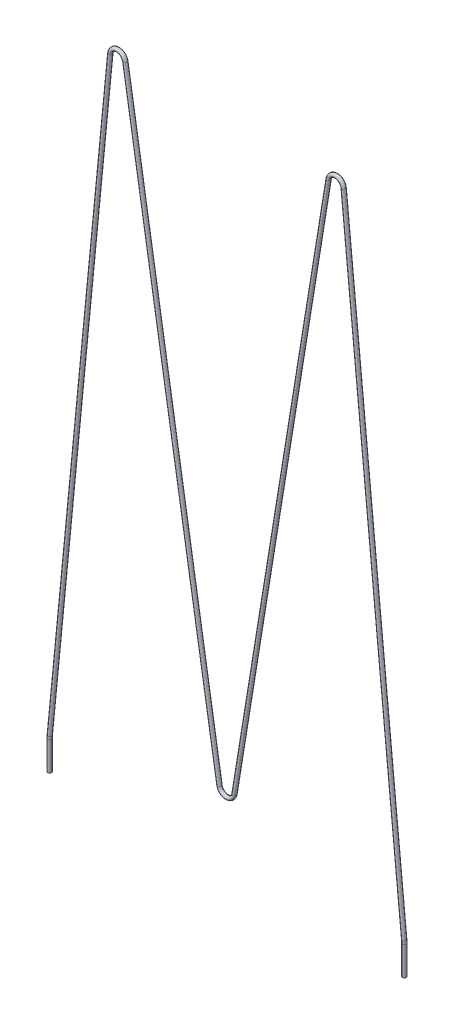
ISO-10303-21;
HEADER;
FILE_DESCRIPTION(('STEP AP214'),'2;1');
FILE_NAME('part.step','',(''),(''),'','','');
FILE_SCHEMA(('AUTOMOTIVE_DESIGN { 1 0 10303 214 1 1 1 1 }'));
ENDSEC;
DATA;
#1=APPLICATION_CONTEXT('core data for automotive mechanical design processes');
#2=APPLICATION_PROTOCOL_DEFINITION('international standard','automotive_design',2000,#1);
#3=PRODUCT_CONTEXT('',#1,'mechanical');
#4=PRODUCT('Part','Part','',(#3));
#5=PRODUCT_RELATED_PRODUCT_CATEGORY('part','',(#4));
#6=PRODUCT_DEFINITION_FORMATION('','',#4);
#7=PRODUCT_DEFINITION_CONTEXT('part definition',#1,'design');
#8=PRODUCT_DEFINITION('design','',#6,#7);
#9=PRODUCT_DEFINITION_SHAPE('','',#8);
#10=(LENGTH_UNIT() NAMED_UNIT(*) SI_UNIT(.MILLI.,.METRE.));
#11=(NAMED_UNIT(*) PLANE_ANGLE_UNIT() SI_UNIT($,.RADIAN.));
#12=(NAMED_UNIT(*) SI_UNIT($,.STERADIAN.) SOLID_ANGLE_UNIT());
#13=UNCERTAINTY_MEASURE_WITH_UNIT(LENGTH_MEASURE(1.E-05),#10,'distance_accuracy_value','');
#14=(GEOMETRIC_REPRESENTATION_CONTEXT(3) GLOBAL_UNCERTAINTY_ASSIGNED_CONTEXT((#13)) GLOBAL_UNIT_ASSIGNED_CONTEXT((#10,
#11,#12)) REPRESENTATION_CONTEXT('',''));
#15=CARTESIAN_POINT('',(0.,0.,0.));
#16=DIRECTION('',(0.,0.,1.));
#17=DIRECTION('',(1.,0.,0.));
#18=AXIS2_PLACEMENT_3D('',#15,#16,#17);
#19=CARTESIAN_POINT('',(11.7,13.902727498159,0.));
#20=DIRECTION('',(0.,-1.,0.));
#21=DIRECTION('',(1.,0.,0.));
#22=AXIS2_PLACEMENT_3D('',#19,#20,#21);
#23=CYLINDRICAL_SURFACE('',#22,0.125);
#24=CARTESIAN_POINT('',(11.7,13.902727498159,0.));
#25=DIRECTION('',(0.,-1.,0.));
#26=DIRECTION('',(0.,0.,1.));
#27=AXIS2_PLACEMENT_3D('',#24,#25,#26);
#28=CIRCLE('',#27,0.125);
#29=CARTESIAN_POINT('',(11.825,13.902727498159,0.));
#30=VERTEX_POINT('',#29);
#31=EDGE_CURVE('E36',#30,#30,#28,.T.);
#32=ORIENTED_EDGE('',*,*,#31,.T.);
#33=EDGE_LOOP('',(#32));
#34=FACE_BOUND('',#33,.T.);
#35=CARTESIAN_POINT('',(11.7,12.,0.));
#36=DIRECTION('',(0.,-1.,0.));
#37=DIRECTION('',(0.,0.,1.));
#38=AXIS2_PLACEMENT_3D('',#35,#36,#37);
#39=CIRCLE('',#38,0.125);
#40=CARTESIAN_POINT('',(11.7,12.,0.125));
#41=VERTEX_POINT('',#40);
#42=EDGE_CURVE('E10',#41,#41,#39,.T.);
#43=ORIENTED_EDGE('',*,*,#42,.F.);
#44=EDGE_LOOP('',(#43));
#45=FACE_BOUND('',#44,.T.);
#46=ADVANCED_FACE('F30',(#34,#45),#23,.T.);
#47=CARTESIAN_POINT('',(9.7,13.902727498159,0.));
#48=DIRECTION('',(0.,0.,-1.));
#49=DIRECTION('',(-1.,0.,0.));
#50=AXIS2_PLACEMENT_3D('',#47,#48,#49);
#51=TOROIDAL_SURFACE('',#50,2.00000000000001,0.125);
#52=CARTESIAN_POINT('',(11.6905603896414,14.096813394583,0.));
#53=DIRECTION('',(0.0970429482120156,-0.995280194820695,0.));
#54=DIRECTION('',(0.,0.,1.));
#55=AXIS2_PLACEMENT_3D('',#52,#53,#54);
#56=CIRCLE('',#55,0.125);
#57=CARTESIAN_POINT('',(11.814970413994,14.1089437631095,0.));
#58=VERTEX_POINT('',#57);
#59=EDGE_CURVE('E40',#58,#58,#56,.T.);
#60=CARTESIAN_POINT('',(9.7,13.902727498159,0.));
#61=DIRECTION('',(0.,0.,-1.));
#62=DIRECTION('',(-1.,0.,0.));
#63=AXIS2_PLACEMENT_3D('',#60,#61,#62);
#64=CIRCLE('',#63,2.12500000000001);
#65=EDGE_CURVE('',#58,#30,#64,.T.);
#66=ORIENTED_EDGE('',*,*,#59,.T.);
#67=ORIENTED_EDGE('',*,*,#31,.F.);
#68=ORIENTED_EDGE('',*,*,#65,.T.);
#69=ORIENTED_EDGE('',*,*,#65,.F.);
#70=EDGE_LOOP('',(#66,#68,#67,#69));
#71=FACE_BOUND('',#70,.T.);
#72=ADVANCED_FACE('F92',(#71),#51,.T.);
#73=CARTESIAN_POINT('',(7.69764009741035,55.048521474106,0.));
#74=DIRECTION('',(0.0970429482120274,-0.995280194820694,0.));
#75=DIRECTION('',(0.995280194820694,0.0970429482120274,0.));
#76=AXIS2_PLACEMENT_3D('',#73,#74,#75);
#77=CYLINDRICAL_SURFACE('',#76,0.125);
#78=CARTESIAN_POINT('',(7.69764009741035,55.048521474106,0.));
#79=DIRECTION('',(0.0970429482120156,-0.995280194820695,0.));
#80=DIRECTION('',(0.,0.,1.));
#81=AXIS2_PLACEMENT_3D('',#78,#79,#80);
#82=CIRCLE('',#81,0.125);
#83=CARTESIAN_POINT('',(7.82205012176294,55.0606518426325,0.));
#84=VERTEX_POINT('',#83);
#85=EDGE_CURVE('E44',#84,#84,#82,.T.);
#86=ORIENTED_EDGE('',*,*,#85,.T.);
#87=EDGE_LOOP('',(#86));
#88=FACE_BOUND('',#87,.T.);
#89=ORIENTED_EDGE('',*,*,#59,.F.);
#90=EDGE_LOOP('',(#89));
#91=FACE_BOUND('',#90,.T.);
#92=ADVANCED_FACE('F96',(#88,#91),#77,.T.);
#93=CARTESIAN_POINT('',(7.2,55.,0.));
#94=DIRECTION('',(0.,0.,-1.));
#95=DIRECTION('',(-1.,0.,0.));
#96=AXIS2_PLACEMENT_3D('',#93,#94,#95);
#97=TOROIDAL_SURFACE('',#96,0.500000000000007,0.125);
#98=CARTESIAN_POINT('',(6.70646471715028,55.0801431505648,0.));
#99=DIRECTION('',(0.16028630112956,0.987070565699436,0.));
#100=DIRECTION('',(0.,0.,1.));
#101=AXIS2_PLACEMENT_3D('',#98,#99,#100);
#102=CIRCLE('',#101,0.125);
#103=CARTESIAN_POINT('',(6.58308089643785,55.100178938206,0.));
#104=VERTEX_POINT('',#103);
#105=EDGE_CURVE('E49',#104,#104,#102,.T.);
#106=CARTESIAN_POINT('',(7.2,55.,0.));
#107=DIRECTION('',(0.,0.,-1.));
#108=DIRECTION('',(-1.,0.,0.));
#109=AXIS2_PLACEMENT_3D('',#106,#107,#108);
#110=CIRCLE('',#109,0.625000000000007);
#111=EDGE_CURVE('',#104,#84,#110,.T.);
#112=ORIENTED_EDGE('',*,*,#105,.T.);
#113=ORIENTED_EDGE('',*,*,#85,.F.);
#114=ORIENTED_EDGE('',*,*,#111,.T.);
#115=ORIENTED_EDGE('',*,*,#111,.F.);
#116=EDGE_LOOP('',(#112,#114,#113,#115));
#117=FACE_BOUND('',#116,.T.);
#118=ADVANCED_FACE('F102',(#117),#97,.T.);
#119=CARTESIAN_POINT('',(0.493535282849715,16.8198568494352,0.));
#120=DIRECTION('',(0.160286301129552,0.987070565699437,0.));
#121=DIRECTION('',(-0.987070565699437,0.160286301129552,0.));
#122=AXIS2_PLACEMENT_3D('',#119,#120,#121);
#123=CYLINDRICAL_SURFACE('',#122,0.125);
#124=CARTESIAN_POINT('',(0.493535282849715,16.8198568494352,0.));
#125=DIRECTION('',(0.16028630112956,0.987070565699436,0.));
#126=DIRECTION('',(0.,0.,1.));
#127=AXIS2_PLACEMENT_3D('',#124,#125,#126);
#128=CIRCLE('',#127,0.125);
#129=CARTESIAN_POINT('',(0.616919103562146,16.799821061794,0.));
#130=VERTEX_POINT('',#129);
#131=EDGE_CURVE('E52',#130,#130,#128,.T.);
#132=ORIENTED_EDGE('',*,*,#131,.T.);
#133=EDGE_LOOP('',(#132));
#134=FACE_BOUND('',#133,.T.);
#135=ORIENTED_EDGE('',*,*,#105,.F.);
#136=EDGE_LOOP('',(#135));
#137=FACE_BOUND('',#136,.T.);
#138=ADVANCED_FACE('F109',(#134,#137),#123,.T.);
#139=CARTESIAN_POINT('',(0.,16.9,0.));
#140=DIRECTION('',(0.,0.,1.));
#141=DIRECTION('',(1.,0.,0.));
#142=AXIS2_PLACEMENT_3D('',#139,#140,#141);
#143=TOROIDAL_SURFACE('',#142,0.499999999999996,0.125);
#144=CARTESIAN_POINT('',(-0.493535282849713,16.8198568494352,0.));
#145=DIRECTION('',(0.160286301129549,-0.987070565699438,0.));
#146=DIRECTION('',(0.,0.,1.));
#147=AXIS2_PLACEMENT_3D('',#144,#145,#146);
#148=CIRCLE('',#147,0.125);
#149=CARTESIAN_POINT('',(-0.616919103562142,16.799821061794,0.));
#150=VERTEX_POINT('',#149);
#151=EDGE_CURVE('E55',#150,#150,#148,.T.);
#152=CARTESIAN_POINT('',(0.,16.9,0.));
#153=DIRECTION('',(0.,0.,1.));
#154=DIRECTION('',(1.,0.,0.));
#155=AXIS2_PLACEMENT_3D('',#152,#153,#154);
#156=CIRCLE('',#155,0.624999999999996);
#157=EDGE_CURVE('',#150,#130,#156,.T.);
#158=ORIENTED_EDGE('',*,*,#151,.T.);
#159=ORIENTED_EDGE('',*,*,#131,.F.);
#160=ORIENTED_EDGE('',*,*,#157,.T.);
#161=ORIENTED_EDGE('',*,*,#157,.F.);
#162=EDGE_LOOP('',(#158,#160,#159,#161));
#163=FACE_BOUND('',#162,.T.);
#164=ADVANCED_FACE('F113',(#163),#143,.T.);
#165=CARTESIAN_POINT('',(-6.70646471715028,55.0801431505648,0.));
#166=DIRECTION('',(0.160286301129552,-0.987070565699437,0.));
#167=DIRECTION('',(0.987070565699437,0.160286301129552,0.));
#168=AXIS2_PLACEMENT_3D('',#165,#166,#167);
#169=CYLINDRICAL_SURFACE('',#168,0.125);
#170=CARTESIAN_POINT('',(-6.70646471715028,55.0801431505648,0.));
#171=DIRECTION('',(0.160286301129549,-0.987070565699438,0.));
#172=DIRECTION('',(0.,0.,1.));
#173=AXIS2_PLACEMENT_3D('',#170,#171,#172);
#174=CIRCLE('',#173,0.125);
#175=CARTESIAN_POINT('',(-6.58308089643785,55.1001789382059,0.));
#176=VERTEX_POINT('',#175);
#177=EDGE_CURVE('E58',#176,#176,#174,.T.);
#178=ORIENTED_EDGE('',*,*,#177,.T.);
#179=EDGE_LOOP('',(#178));
#180=FACE_BOUND('',#179,.T.);
#181=ORIENTED_EDGE('',*,*,#151,.F.);
#182=EDGE_LOOP('',(#181));
#183=FACE_BOUND('',#182,.T.);
#184=ADVANCED_FACE('F117',(#180,#183),#169,.T.);
#185=CARTESIAN_POINT('',(-7.2,55.,0.));
#186=DIRECTION('',(0.,0.,-1.));
#187=DIRECTION('',(-1.,0.,0.));
#188=AXIS2_PLACEMENT_3D('',#185,#186,#187);
#189=TOROIDAL_SURFACE('',#188,0.500000000000001,0.125);
#190=CARTESIAN_POINT('',(-7.69764009741035,55.048521474106,0.));
#191=DIRECTION('',(0.0970429482120273,0.995280194820694,0.));
#192=DIRECTION('',(0.,0.,1.));
#193=AXIS2_PLACEMENT_3D('',#190,#191,#192);
#194=CIRCLE('',#193,0.125);
#195=CARTESIAN_POINT('',(-7.82205012176293,55.0606518426325,0.));
#196=VERTEX_POINT('',#195);
#197=EDGE_CURVE('E61',#196,#196,#194,.T.);
#198=CARTESIAN_POINT('',(-7.2,55.,0.));
#199=DIRECTION('',(0.,0.,-1.));
#200=DIRECTION('',(-1.,0.,0.));
#201=AXIS2_PLACEMENT_3D('',#198,#199,#200);
#202=CIRCLE('',#201,0.625000000000001);
#203=EDGE_CURVE('',#196,#176,#202,.T.);
#204=ORIENTED_EDGE('',*,*,#197,.T.);
#205=ORIENTED_EDGE('',*,*,#177,.F.);
#206=ORIENTED_EDGE('',*,*,#203,.T.);
#207=ORIENTED_EDGE('',*,*,#203,.F.);
#208=EDGE_LOOP('',(#204,#206,#205,#207));
#209=FACE_BOUND('',#208,.T.);
#210=ADVANCED_FACE('F121',(#209),#189,.T.);
#211=CARTESIAN_POINT('',(-11.6905603896414,14.0968133945831,0.));
#212=DIRECTION('',(0.0970429482120274,0.995280194820694,0.));
#213=DIRECTION('',(-0.995280194820694,0.0970429482120275,0.));
#214=AXIS2_PLACEMENT_3D('',#211,#212,#213);
#215=CYLINDRICAL_SURFACE('',#214,0.125);
#216=CARTESIAN_POINT('',(-11.6905603896414,14.0968133945831,0.));
#217=DIRECTION('',(0.0970429482120273,0.995280194820694,0.));
#218=DIRECTION('',(0.,0.,1.));
#219=AXIS2_PLACEMENT_3D('',#216,#217,#218);
#220=CIRCLE('',#219,0.125);
#221=CARTESIAN_POINT('',(-11.814970413994,14.1089437631096,0.));
#222=VERTEX_POINT('',#221);
#223=EDGE_CURVE('E64',#222,#222,#220,.T.);
#224=ORIENTED_EDGE('',*,*,#223,.T.);
#225=EDGE_LOOP('',(#224));
#226=FACE_BOUND('',#225,.T.);
#227=ORIENTED_EDGE('',*,*,#197,.F.);
#228=EDGE_LOOP('',(#227));
#229=FACE_BOUND('',#228,.T.);
#230=ADVANCED_FACE('F125',(#226,#229),#215,.T.);
#231=CARTESIAN_POINT('',(-9.7,13.902727498159,0.));
#232=DIRECTION('',(0.,0.,-1.));
#233=DIRECTION('',(-1.,0.,0.));
#234=AXIS2_PLACEMENT_3D('',#231,#232,#233);
#235=TOROIDAL_SURFACE('',#234,2.,0.125);
#236=CARTESIAN_POINT('',(-11.7,13.902727498159,0.));
#237=DIRECTION('',(0.,1.,0.));
#238=DIRECTION('',(0.,0.,1.));
#239=AXIS2_PLACEMENT_3D('',#236,#237,#238);
#240=CIRCLE('',#239,0.125);
#241=CARTESIAN_POINT('',(-11.825,13.902727498159,0.));
#242=VERTEX_POINT('',#241);
#243=EDGE_CURVE('E67',#242,#242,#240,.T.);
#244=CARTESIAN_POINT('',(-9.7,13.902727498159,0.));
#245=DIRECTION('',(0.,0.,-1.));
#246=DIRECTION('',(-1.,0.,0.));
#247=AXIS2_PLACEMENT_3D('',#244,#245,#246);
#248=CIRCLE('',#247,2.125);
#249=EDGE_CURVE('',#242,#222,#248,.T.);
#250=ORIENTED_EDGE('',*,*,#243,.T.);
#251=ORIENTED_EDGE('',*,*,#223,.F.);
#252=ORIENTED_EDGE('',*,*,#249,.T.);
#253=ORIENTED_EDGE('',*,*,#249,.F.);
#254=EDGE_LOOP('',(#250,#252,#251,#253));
#255=FACE_BOUND('',#254,.T.);
#256=ADVANCED_FACE('F74',(#255),#235,.T.);
#257=CARTESIAN_POINT('',(-11.7,13.902727498159,0.));
#258=DIRECTION('',(0.,-1.,0.));
#259=DIRECTION('',(1.,0.,0.));
#260=AXIS2_PLACEMENT_3D('',#257,#258,#259);
#261=CYLINDRICAL_SURFACE('',#260,0.125);
#262=ORIENTED_EDGE('',*,*,#243,.F.);
#263=EDGE_LOOP('',(#262));
#264=FACE_BOUND('',#263,.T.);
#265=CARTESIAN_POINT('',(-11.7,12.,0.));
#266=DIRECTION('',(0.,1.,0.));
#267=DIRECTION('',(0.,0.,1.));
#268=AXIS2_PLACEMENT_3D('',#265,#266,#267);
#269=CIRCLE('',#268,0.125);
#270=CARTESIAN_POINT('',(-11.7,12.,0.125));
#271=VERTEX_POINT('',#270);
#272=EDGE_CURVE('E68',#271,#271,#269,.T.);
#273=ORIENTED_EDGE('',*,*,#272,.T.);
#274=EDGE_LOOP('',(#273));
#275=FACE_BOUND('',#274,.T.);
#276=ADVANCED_FACE('F77',(#264,#275),#261,.T.);
#277=CARTESIAN_POINT('',(11.7,12.,0.));
#278=DIRECTION('',(0.,-1.,0.));
#279=DIRECTION('',(0.,0.,1.));
#280=AXIS2_PLACEMENT_3D('',#277,#278,#279);
#281=PLANE('',#280);
#282=ORIENTED_EDGE('',*,*,#42,.T.);
#283=EDGE_LOOP('',(#282));
#284=FACE_BOUND('',#283,.T.);
#285=ADVANCED_FACE('F80',(#284),#281,.T.);
#286=CARTESIAN_POINT('',(-11.7,12.,0.));
#287=DIRECTION('',(0.,1.,0.));
#288=DIRECTION('',(0.,0.,1.));
#289=AXIS2_PLACEMENT_3D('',#286,#287,#288);
#290=PLANE('',#289);
#291=ORIENTED_EDGE('',*,*,#272,.F.);
#292=EDGE_LOOP('',(#291));
#293=FACE_BOUND('',#292,.T.);
#294=ADVANCED_FACE('F84',(#293),#290,.F.);
#295=CLOSED_SHELL('',(#46,#72,#92,#118,#138,#164,#184,#210,#230,#256,#276,#285,#294));
#296=MANIFOLD_SOLID_BREP('B2',#295);
#297=ADVANCED_BREP_SHAPE_REPRESENTATION('',(#18,#296),#14);
#298=SHAPE_DEFINITION_REPRESENTATION(#9,#297);
ENDSEC;
END-ISO-10303-21;
